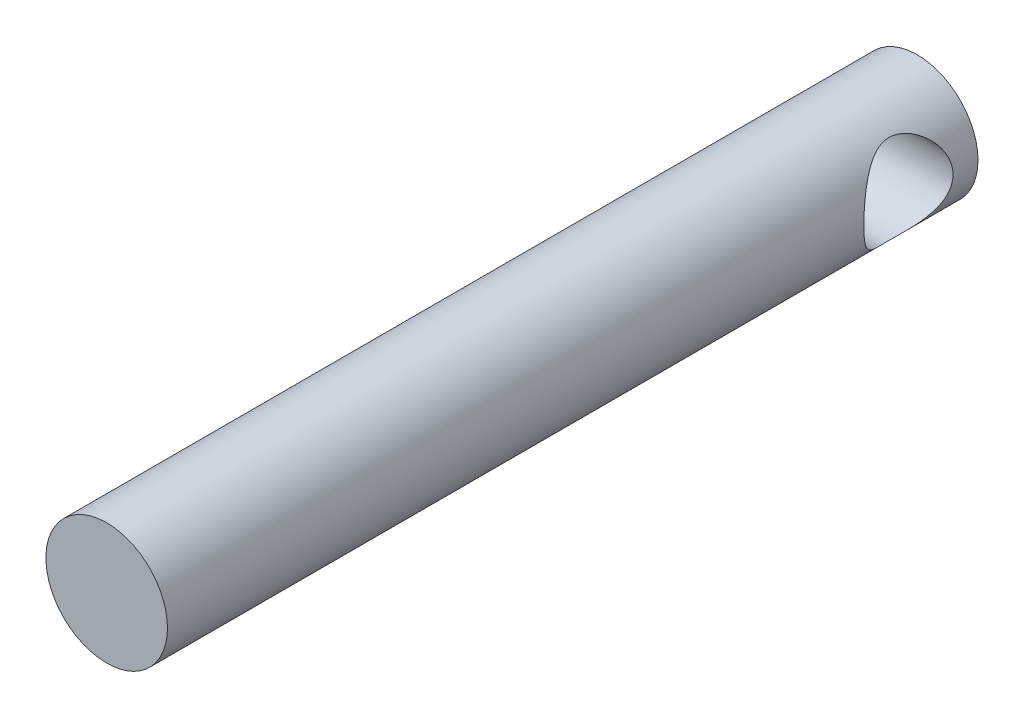
ISO-10303-21;
HEADER;
FILE_DESCRIPTION(('STEP AP214'),'2;1');
FILE_NAME('part.step','',(''),(''),'','','');
FILE_SCHEMA(('AUTOMOTIVE_DESIGN { 1 0 10303 214 1 1 1 1 }'));
ENDSEC;
DATA;
#1=APPLICATION_CONTEXT('core data for automotive mechanical design processes');
#2=APPLICATION_PROTOCOL_DEFINITION('international standard','automotive_design',2000,#1);
#3=PRODUCT_CONTEXT('',#1,'mechanical');
#4=PRODUCT('Part','Part','',(#3));
#5=PRODUCT_RELATED_PRODUCT_CATEGORY('part','',(#4));
#6=PRODUCT_DEFINITION_FORMATION('','',#4);
#7=PRODUCT_DEFINITION_CONTEXT('part definition',#1,'design');
#8=PRODUCT_DEFINITION('design','',#6,#7);
#9=PRODUCT_DEFINITION_SHAPE('','',#8);
#10=(LENGTH_UNIT() NAMED_UNIT(*) SI_UNIT(.MILLI.,.METRE.));
#11=(NAMED_UNIT(*) PLANE_ANGLE_UNIT() SI_UNIT($,.RADIAN.));
#12=(NAMED_UNIT(*) SI_UNIT($,.STERADIAN.) SOLID_ANGLE_UNIT());
#13=UNCERTAINTY_MEASURE_WITH_UNIT(LENGTH_MEASURE(1.E-05),#10,'distance_accuracy_value','');
#14=(GEOMETRIC_REPRESENTATION_CONTEXT(3) GLOBAL_UNCERTAINTY_ASSIGNED_CONTEXT((#13)) GLOBAL_UNIT_ASSIGNED_CONTEXT((#10,
#11,#12)) REPRESENTATION_CONTEXT('',''));
#15=CARTESIAN_POINT('',(0.,0.,0.));
#16=DIRECTION('',(0.,0.,1.));
#17=DIRECTION('',(1.,0.,0.));
#18=AXIS2_PLACEMENT_3D('',#15,#16,#17);
#19=CARTESIAN_POINT('',(0.,0.,100.));
#20=DIRECTION('',(0.,0.,-1.));
#21=DIRECTION('',(-1.,0.,0.));
#22=AXIS2_PLACEMENT_3D('',#19,#20,#21);
#23=CYLINDRICAL_SURFACE('',#22,7.5);
#24=CARTESIAN_POINT('',(-7.5,0.,3.08597047534755));
#25=CARTESIAN_POINT('',(-7.49999872781919,0.135055376285235,3.08597179854398));
#26=CARTESIAN_POINT('',(-7.49634306059152,0.270144536737901,3.09095397315725));
#27=CARTESIAN_POINT('',(-7.48180308421566,0.539261470162019,3.11080639864596));
#28=CARTESIAN_POINT('',(-7.47091446264143,0.67328856163776,3.12568254850565));
#29=CARTESIAN_POINT('',(-7.44214015531739,0.9394116802929,3.16511884737146));
#30=CARTESIAN_POINT('',(-7.42424110508039,1.07150351620524,3.18969749365812));
#31=CARTESIAN_POINT('',(-7.38185166150815,1.33257988419793,3.24816766952421));
#32=CARTESIAN_POINT('',(-7.35735834023733,1.46156300818846,3.28206333611316));
#33=CARTESIAN_POINT('',(-7.30249183815425,1.71472311019973,3.35843862134301));
#34=CARTESIAN_POINT('',(-7.27215771357647,1.83892577867661,3.40086130004706));
#35=CARTESIAN_POINT('',(-7.20611318793602,2.08276667780845,3.49390453815138));
#36=CARTESIAN_POINT('',(-7.17040066629477,2.2024030846663,3.5445283316616));
#37=CARTESIAN_POINT('',(-7.05622669753856,2.55344016572005,3.70781174000904));
#38=CARTESIAN_POINT('',(-6.97065447299209,2.77729966822013,3.83198506910978));
#39=CARTESIAN_POINT('',(-6.77776227191752,3.22115916269509,4.11937813755444));
#40=CARTESIAN_POINT('',(-6.6691694070733,3.43893620340117,4.2851294084911));
#41=CARTESIAN_POINT('',(-6.44324402134699,3.84561003935518,4.64451900701212));
#42=CARTESIAN_POINT('',(-6.32589794860186,4.03446060980524,4.83820102895981));
#43=CARTESIAN_POINT('',(-6.13800764446043,4.31168247542055,5.16759191390637));
#44=CARTESIAN_POINT('',(-6.06763426733091,4.409904087226,5.29526179990379));
#45=CARTESIAN_POINT('',(-5.92853120141975,4.59520635302921,5.55940236700665));
#46=CARTESIAN_POINT('',(-5.85980199240363,4.68228378665279,5.6958755749819));
#47=CARTESIAN_POINT('',(-5.72626078142968,4.84468579485347,5.97726090074965));
#48=CARTESIAN_POINT('',(-5.66144448655279,4.92002339840692,6.12216341468201));
#49=CARTESIAN_POINT('',(-5.53822634478387,5.05832181904602,6.42023903924434));
#50=CARTESIAN_POINT('',(-5.47982091608781,5.121289562966,6.57340745954835));
#51=CARTESIAN_POINT('',(-5.35442072304565,5.25271123356576,6.94023868191979));
#52=CARTESIAN_POINT('',(-5.29101908166431,5.31603747165639,7.1570930844747));
#53=CARTESIAN_POINT('',(-5.21419227145622,5.3910549643512,7.49073723137132));
#54=CARTESIAN_POINT('',(-5.19163660964995,5.41272576289551,7.60328201187608));
#55=CARTESIAN_POINT('',(-5.15344634139993,5.44909999266488,7.83063095383464));
#56=CARTESIAN_POINT('',(-5.13780835747329,5.46380682422056,7.94543398406125));
#57=CARTESIAN_POINT('',(-5.11404468692043,5.48605660978944,8.17746374036437));
#58=CARTESIAN_POINT('',(-5.1059811447753,5.49354031520013,8.2947025855346));
#59=CARTESIAN_POINT('',(-5.09797815371618,5.50096807092452,8.52969650054809));
#60=CARTESIAN_POINT('',(-5.09803838234576,5.50091242049748,8.64745154971617));
#61=CARTESIAN_POINT('',(-5.10628189650357,5.49326092931533,8.88247313926765));
#62=CARTESIAN_POINT('',(-5.11446836477208,5.4856621341961,8.99973947016736));
#63=CARTESIAN_POINT('',(-5.13857352751111,5.46308811304013,9.23279944078204));
#64=CARTESIAN_POINT('',(-5.15449611659219,5.44810917154818,9.34859230854562));
#65=CARTESIAN_POINT('',(-5.1954642444704,5.40906947975743,9.59021821604044));
#66=CARTESIAN_POINT('',(-5.22130921965144,5.38420273305327,9.71578530526354));
#67=CARTESIAN_POINT('',(-5.28038625532567,5.3262777494127,9.96326710451768));
#68=CARTESIAN_POINT('',(-5.31362326400076,5.29321402376028,10.0851793056641));
#69=CARTESIAN_POINT('',(-5.42250426028369,5.18238609517369,10.4449698756281));
#70=CARTESIAN_POINT('',(-5.50726798460308,5.09302987876594,10.676635577664));
#71=CARTESIAN_POINT('',(-5.6609673321388,4.92058517703288,11.0487403371496));
#72=CARTESIAN_POINT('',(-5.72610583155606,4.84488221009645,11.1943763599482));
#73=CARTESIAN_POINT('',(-5.86029971812211,4.68167049468289,11.4770912564212));
#74=CARTESIAN_POINT('',(-5.92935637190767,4.59415791571924,11.6141673324591));
#75=CARTESIAN_POINT('',(-6.06920583646394,4.40775882242906,11.8796004970038));
#76=CARTESIAN_POINT('',(-6.14000021296856,4.30886173045789,12.0079492977922));
#77=CARTESIAN_POINT('',(-6.28133658605871,4.10008541692263,12.2555082660752));
#78=CARTESIAN_POINT('',(-6.35187861052145,3.99020744981545,12.3747194747066));
#79=CARTESIAN_POINT('',(-6.491956366296,3.75807666806383,12.6051724549875));
#80=CARTESIAN_POINT('',(-6.56146368744374,3.63567060437135,12.7162774127622));
#81=CARTESIAN_POINT('',(-6.69671757514575,3.38007095364637,12.9279342129075));
#82=CARTESIAN_POINT('',(-6.76246373912707,3.24687621552764,13.0284849265697));
#83=CARTESIAN_POINT('',(-6.88838914312177,2.97037524158165,13.2179138283151));
#84=CARTESIAN_POINT('',(-6.94857895584762,2.82708916401772,13.3068143258304));
#85=CARTESIAN_POINT('',(-7.06187749472335,2.53081248353643,13.4720454833553));
#86=CARTESIAN_POINT('',(-7.11498887428151,2.37782554898164,13.5483808560409));
#87=CARTESIAN_POINT('',(-7.2000517197271,2.10339995807772,13.6694822047324));
#88=CARTESIAN_POINT('',(-7.23393950587857,1.98391039838395,13.7173273430677));
#89=CARTESIAN_POINT('',(-7.29630003042455,1.74062165575659,13.8048725890052));
#90=CARTESIAN_POINT('',(-7.32477396550157,1.61682343238804,13.8445744967474));
#91=CARTESIAN_POINT('',(-7.37573339701597,1.36563919041155,13.9153273866667));
#92=CARTESIAN_POINT('',(-7.39822200531386,1.23825507440744,13.94638286464));
#93=CARTESIAN_POINT('',(-7.43675314233005,0.980643834670608,13.9994379643167));
#94=CARTESIAN_POINT('',(-7.45279550586377,0.850416638174297,14.0214373539589));
#95=CARTESIAN_POINT('',(-7.47812124681698,0.587542047162258,14.0561111029814));
#96=CARTESIAN_POINT('',(-7.48737768757857,0.454887127086312,14.0687483013015));
#97=CARTESIAN_POINT('',(-7.49880900094007,0.188703221563385,14.0843488482249));
#98=CARTESIAN_POINT('',(-7.50098388430415,0.055174237445314,14.0873122115327));
#99=CARTESIAN_POINT('',(-7.49819970625039,-0.211672215431253,14.0835154275062));
#100=CARTESIAN_POINT('',(-7.49324052710339,-0.344989680662833,14.0767551197079));
#101=CARTESIAN_POINT('',(-7.47630731285209,-0.610330928966863,14.0536237914234));
#102=CARTESIAN_POINT('',(-7.46433348886744,-0.74235475085249,14.0372530601819));
#103=CARTESIAN_POINT('',(-7.43458404888988,-0.996127598183575,13.99644394322));
#104=CARTESIAN_POINT('',(-7.41720623271196,-1.11801265783861,13.9725576795728));
#105=CARTESIAN_POINT('',(-7.3768555483523,-1.35902913349132,13.9168579726806));
#106=CARTESIAN_POINT('',(-7.35388077440325,-1.47815959638696,13.8850418292217));
#107=CARTESIAN_POINT('',(-7.2771855252572,-1.83033961107277,13.7782646761783));
#108=CARTESIAN_POINT('',(-7.2156707674409,-2.05836895903749,13.6919434743005));
#109=CARTESIAN_POINT('',(-7.07042015885762,-2.51415347482978,13.4846177503613));
#110=CARTESIAN_POINT('',(-6.9853050014875,-2.74044117807819,13.3613989176591));
#111=CARTESIAN_POINT('',(-6.80123924784217,-3.16982089007015,13.0878693603201));
#112=CARTESIAN_POINT('',(-6.70228010778746,-3.37289843301909,12.9375418889684));
#113=CARTESIAN_POINT('',(-6.4774144719406,-3.78930950711465,12.5833458299695));
#114=CARTESIAN_POINT('',(-6.34989238638164,-3.99770705663352,12.3747138159197));
#115=CARTESIAN_POINT('',(-6.0934354440748,-4.3786640149564,11.9271926189942));
#116=CARTESIAN_POINT('',(-5.9644993924964,-4.55119018353756,11.688275699621));
#117=CARTESIAN_POINT('',(-5.7855861135287,-4.77335116540849,11.3214350170788));
#118=CARTESIAN_POINT('',(-5.73120268589005,-4.83836790797266,11.2047808389871));
#119=CARTESIAN_POINT('',(-5.62600457678679,-4.96029747028213,10.9657756008219));
#120=CARTESIAN_POINT('',(-5.57519008084769,-5.01720986889319,10.8434242451382));
#121=CARTESIAN_POINT('',(-5.43051020385196,-5.17492197581214,10.468400332542));
#122=CARTESIAN_POINT('',(-5.34408309596921,-5.26308513884061,10.207123385651));
#123=CARTESIAN_POINT('',(-5.22145346456742,-5.38444238861026,9.72785370711709));
#124=CARTESIAN_POINT('',(-5.17827183206794,-5.42561477238887,9.51372310800645));
#125=CARTESIAN_POINT('',(-5.13323849505432,-5.46811147921666,9.18748915160827));
#126=CARTESIAN_POINT('',(-5.12151761069926,-5.4790664673344,9.0779274900422));
#127=CARTESIAN_POINT('',(-5.10508638352146,-5.49438197669627,8.85783887353597));
#128=CARTESIAN_POINT('',(-5.10037345478035,-5.49874493039446,8.74731228980039));
#129=CARTESIAN_POINT('',(-5.09816790615531,-5.50078933677458,8.52585121460462));
#130=CARTESIAN_POINT('',(-5.10069338025312,-5.49845404570806,8.41491639444144));
#131=CARTESIAN_POINT('',(-5.11288750021936,-5.48711674545356,8.19378891071827));
#132=CARTESIAN_POINT('',(-5.12255610208961,-5.47811477732905,8.08359624259119));
#133=CARTESIAN_POINT('',(-5.1486386254202,-5.45360781633496,7.86464492862954));
#134=CARTESIAN_POINT('',(-5.16505903855263,-5.43809656468042,7.75588776714589));
#135=CARTESIAN_POINT('',(-5.20401147899249,-5.40083219264973,7.54052035196363));
#136=CARTESIAN_POINT('',(-5.22654668880262,-5.37907582160102,7.43391124736686));
#137=CARTESIAN_POINT('',(-5.28416429207551,-5.32256219838172,7.19325103150881));
#138=CARTESIAN_POINT('',(-5.32099189458983,-5.28586628572407,7.0600712594805));
#139=CARTESIAN_POINT('',(-5.40173729559201,-5.20332237260051,6.79872596922428));
#140=CARTESIAN_POINT('',(-5.44566064268792,-5.15746720324805,6.6705644733383));
#141=CARTESIAN_POINT('',(-5.53898476067651,-5.05710891977597,6.41941191219419));
#142=CARTESIAN_POINT('',(-5.58839698732747,-5.0025876125532,6.2964324285748));
#143=CARTESIAN_POINT('',(-5.69106606555172,-4.88547151161298,6.05614271758081));
#144=CARTESIAN_POINT('',(-5.7443215683152,-4.8228795443102,5.93883052515066));
#145=CARTESIAN_POINT('',(-5.86815946869371,-4.67189928198876,5.67879046555703));
#146=CARTESIAN_POINT('',(-5.93951892192237,-4.58112221939404,5.53781491634325));
#147=CARTESIAN_POINT('',(-6.08390491099018,-4.38756103655435,5.2652391097885));
#148=CARTESIAN_POINT('',(-6.15693189903125,-4.28477362747145,5.13364143638267));
#149=CARTESIAN_POINT('',(-6.30248987083129,-4.06763974643133,4.88028366797739));
#150=CARTESIAN_POINT('',(-6.37502122231343,-3.95330313867053,4.75851533501611));
#151=CARTESIAN_POINT('',(-6.51778084543039,-3.71322507453858,4.5251846739232));
#152=CARTESIAN_POINT('',(-6.58800843456112,-3.58748027923322,4.41362535306718));
#153=CARTESIAN_POINT('',(-6.71361872569178,-3.34557481560278,4.21820721600104));
#154=CARTESIAN_POINT('',(-6.76959994295165,-3.23101345039067,4.13275035792778));
#155=CARTESIAN_POINT('',(-6.87757829529997,-2.99429988597506,3.9702615563987));
#156=CARTESIAN_POINT('',(-6.92957618722729,-2.8721491367956,3.89322801130376));
#157=CARTESIAN_POINT('',(-7.02852674821951,-2.62069734322939,3.74830698989008));
#158=CARTESIAN_POINT('',(-7.07548275384994,-2.49140111440139,3.68041345734679));
#159=CARTESIAN_POINT('',(-7.16336813757383,-2.22613270064982,3.55448192094648));
#160=CARTESIAN_POINT('',(-7.20429864461332,-2.09016177268971,3.49644207057636));
#161=CARTESIAN_POINT('',(-7.2735678661188,-1.83308206058562,3.39889193509535));
#162=CARTESIAN_POINT('',(-7.30287426185105,-1.71279149527973,3.35790863398388));
#163=CARTESIAN_POINT('',(-7.35588349079815,-1.46853230969731,3.28411404302907));
#164=CARTESIAN_POINT('',(-7.37958731123702,-1.34456434175159,3.25130131340312));
#165=CARTESIAN_POINT('',(-7.42087588623365,-1.0939370844016,3.19433035301489));
#166=CARTESIAN_POINT('',(-7.43847355548644,-0.967284083858489,3.17015385312983));
#167=CARTESIAN_POINT('',(-7.46723870549868,-0.711924660657242,3.13071272536483));
#168=CARTESIAN_POINT('',(-7.4784095918494,-0.583219362754491,3.11544337747106));
#169=CARTESIAN_POINT('',(-7.49082132823811,-0.378563008870326,3.0984919830267));
#170=CARTESIAN_POINT('',(-7.49426031962745,-0.302977112208774,3.0937994668424));
#171=CARTESIAN_POINT('',(-7.49885015595833,-0.15159770801625,3.08753814586164));
#172=CARTESIAN_POINT('',(-7.50000071405242,-0.0758041756510316,3.08596973266098));
#173=CARTESIAN_POINT('',(-7.5,0.,3.08597047534755));
#174=B_SPLINE_CURVE_WITH_KNOTS('',3,(#24,#25,#26,#27,#28,#29,#30,#31,#32,#33,#34,#35,#36,#37,
#38,#39,#40,#41,#42,#43,#44,#45,#46,#47,#48,#49,#50,#51,#52,#53,#54,#55,#56,#57,#58,#59,#60,#61,
#62,#63,#64,#65,#66,#67,#68,#69,#70,#71,#72,#73,#74,#75,#76,#77,#78,#79,#80,#81,#82,#83,#84,#85,
#86,#87,#88,#89,#90,#91,#92,#93,#94,#95,#96,#97,#98,#99,#100,#101,#102,#103,#104,#105,#106,#107,
#108,#109,#110,#111,#112,#113,#114,#115,#116,#117,#118,#119,#120,#121,#122,#123,#124,#125,#126,
#127,#128,#129,#130,#131,#132,#133,#134,#135,#136,#137,#138,#139,#140,#141,#142,#143,#144,#145,
#146,#147,#148,#149,#150,#151,#152,#153,#154,#155,#156,#157,#158,#159,#160,#161,#162,#163,#164,
#165,#166,#167,#168,#169,#170,#171,#172,#173),.UNSPECIFIED.,.T.,.F.,(4,2,2,2,2,2,2,2,2,2,2,2,2,
2,2,2,2,2,2,2,2,2,2,2,2,2,2,2,2,2,2,2,2,2,2,2,2,2,2,2,2,2,2,2,2,2,2,2,2,2,2,2,2,2,2,2,2,2,2,2,2,
2,2,2,2,2,2,2,2,2,2,2,2,2,4),(0.,0.405084678598993,0.810411093486331,1.21651400218459,
1.6227975236825,2.02645316243227,2.43026837202856,3.23684806222179,4.11715055319306,
4.99884542112994,5.52569884024144,6.05270416399921,6.57912038152025,7.10524097259587,
7.806157309861,8.15623361395328,8.50613880784489,8.85889034751931,9.21162788544878,
9.56450363184444,9.91755721153761,10.3087330555004,10.7001715425412,11.4838631988305,
12.0130929491456,12.5424947713196,13.0723925060716,13.6022297742729,14.1395725330086,
14.6769726986712,15.2133282519053,15.7494821789707,16.148388676375,16.5472068963585,
16.9458173579521,17.3444380332601,17.744632586486,18.1448265314049,18.5450270805614,
18.9452155855083,19.3210291906595,19.6969709398558,20.4482755902175,21.25940071421,
22.0710286486779,23.0313359579053,23.9925292086959,24.4247911809861,24.8570756071531,
25.7192319100497,26.3831376583103,26.7149563451303,27.0466525612609,27.3791786477155,
27.7117026859887,28.044547186921,28.3775652532424,28.8058220659445,29.2344153950807,
29.6639206656868,30.0932759263228,30.6392608668039,31.1853956683092,31.7310678969163,
32.276900350608,32.7369545085679,33.1969210374958,33.65658127391,34.1161552778139,
34.5070029259783,34.8977816518507,35.2877287575536,35.6774690371395,35.904807353215,
36.1321741635907),.UNSPECIFIED.);
#175=CARTESIAN_POINT('',(-7.5,0.,3.08597047534755));
#176=VERTEX_POINT('',#175);
#177=EDGE_CURVE('E10',#176,#176,#174,.T.);
#178=ORIENTED_EDGE('',*,*,#177,.T.);
#179=EDGE_LOOP('',(#178));
#180=FACE_BOUND('',#179,.T.);
#181=CARTESIAN_POINT('',(7.5,0.,3.08597047534755));
#182=CARTESIAN_POINT('',(7.49999872781919,-0.135055376285235,3.08597179854398));
#183=CARTESIAN_POINT('',(7.49634306059152,-0.270144536737901,3.09095397315725));
#184=CARTESIAN_POINT('',(7.48180308421566,-0.539261470162019,3.11080639864596));
#185=CARTESIAN_POINT('',(7.47091446264143,-0.67328856163776,3.12568254850565));
#186=CARTESIAN_POINT('',(7.44214015531739,-0.9394116802929,3.16511884737146));
#187=CARTESIAN_POINT('',(7.42424110508039,-1.07150351620524,3.18969749365812));
#188=CARTESIAN_POINT('',(7.38185166150815,-1.33257988419793,3.24816766952421));
#189=CARTESIAN_POINT('',(7.35735834023733,-1.46156300818846,3.28206333611316));
#190=CARTESIAN_POINT('',(7.30249183815425,-1.71472311019973,3.35843862134301));
#191=CARTESIAN_POINT('',(7.27215771357647,-1.83892577867661,3.40086130004706));
#192=CARTESIAN_POINT('',(7.20611318793602,-2.08276667780845,3.49390453815138));
#193=CARTESIAN_POINT('',(7.17040066629477,-2.2024030846663,3.5445283316616));
#194=CARTESIAN_POINT('',(7.05622669753856,-2.55344016572005,3.70781174000904));
#195=CARTESIAN_POINT('',(6.97065447299209,-2.77729966822013,3.83198506910978));
#196=CARTESIAN_POINT('',(6.77776227191752,-3.22115916269509,4.11937813755444));
#197=CARTESIAN_POINT('',(6.6691694070733,-3.43893620340117,4.2851294084911));
#198=CARTESIAN_POINT('',(6.44324402134699,-3.84561003935518,4.64451900701212));
#199=CARTESIAN_POINT('',(6.32589794860186,-4.03446060980524,4.83820102895981));
#200=CARTESIAN_POINT('',(6.13800764446043,-4.31168247542055,5.16759191390637));
#201=CARTESIAN_POINT('',(6.06763426733091,-4.409904087226,5.29526179990379));
#202=CARTESIAN_POINT('',(5.92853120141975,-4.59520635302921,5.55940236700665));
#203=CARTESIAN_POINT('',(5.85980199240363,-4.68228378665279,5.6958755749819));
#204=CARTESIAN_POINT('',(5.72626078142968,-4.84468579485347,5.97726090074965));
#205=CARTESIAN_POINT('',(5.66144448655279,-4.92002339840692,6.12216341468201));
#206=CARTESIAN_POINT('',(5.53822634478387,-5.05832181904602,6.42023903924434));
#207=CARTESIAN_POINT('',(5.47982091608781,-5.121289562966,6.57340745954835));
#208=CARTESIAN_POINT('',(5.35442072304565,-5.25271123356576,6.94023868191979));
#209=CARTESIAN_POINT('',(5.29101908166431,-5.31603747165639,7.1570930844747));
#210=CARTESIAN_POINT('',(5.21419227145622,-5.3910549643512,7.49073723137132));
#211=CARTESIAN_POINT('',(5.19163660964995,-5.41272576289551,7.60328201187608));
#212=CARTESIAN_POINT('',(5.15344634139993,-5.44909999266488,7.83063095383464));
#213=CARTESIAN_POINT('',(5.13780835747329,-5.46380682422056,7.94543398406125));
#214=CARTESIAN_POINT('',(5.11404468692043,-5.48605660978944,8.17746374036437));
#215=CARTESIAN_POINT('',(5.1059811447753,-5.49354031520013,8.2947025855346));
#216=CARTESIAN_POINT('',(5.09797815371618,-5.50096807092452,8.52969650054809));
#217=CARTESIAN_POINT('',(5.09803838234576,-5.50091242049748,8.64745154971617));
#218=CARTESIAN_POINT('',(5.10628189650357,-5.49326092931533,8.88247313926765));
#219=CARTESIAN_POINT('',(5.11446836477208,-5.4856621341961,8.99973947016736));
#220=CARTESIAN_POINT('',(5.13857352751111,-5.46308811304013,9.23279944078204));
#221=CARTESIAN_POINT('',(5.15449611659219,-5.44810917154818,9.34859230854562));
#222=CARTESIAN_POINT('',(5.1954642444704,-5.40906947975743,9.59021821604044));
#223=CARTESIAN_POINT('',(5.22130921965144,-5.38420273305327,9.71578530526354));
#224=CARTESIAN_POINT('',(5.28038625532567,-5.3262777494127,9.96326710451768));
#225=CARTESIAN_POINT('',(5.31362326400076,-5.29321402376028,10.0851793056641));
#226=CARTESIAN_POINT('',(5.42250426028369,-5.18238609517369,10.4449698756281));
#227=CARTESIAN_POINT('',(5.50726798460308,-5.09302987876594,10.676635577664));
#228=CARTESIAN_POINT('',(5.6609673321388,-4.92058517703288,11.0487403371496));
#229=CARTESIAN_POINT('',(5.72610583155606,-4.84488221009645,11.1943763599482));
#230=CARTESIAN_POINT('',(5.86029971812211,-4.68167049468289,11.4770912564212));
#231=CARTESIAN_POINT('',(5.92935637190767,-4.59415791571924,11.6141673324591));
#232=CARTESIAN_POINT('',(6.06920583646394,-4.40775882242906,11.8796004970038));
#233=CARTESIAN_POINT('',(6.14000021296856,-4.30886173045789,12.0079492977922));
#234=CARTESIAN_POINT('',(6.28133658605871,-4.10008541692263,12.2555082660752));
#235=CARTESIAN_POINT('',(6.35187861052145,-3.99020744981545,12.3747194747066));
#236=CARTESIAN_POINT('',(6.491956366296,-3.75807666806383,12.6051724549875));
#237=CARTESIAN_POINT('',(6.56146368744374,-3.63567060437135,12.7162774127622));
#238=CARTESIAN_POINT('',(6.69671757514575,-3.38007095364637,12.9279342129075));
#239=CARTESIAN_POINT('',(6.76246373912707,-3.24687621552764,13.0284849265697));
#240=CARTESIAN_POINT('',(6.88838914312177,-2.97037524158165,13.2179138283151));
#241=CARTESIAN_POINT('',(6.94857895584762,-2.82708916401772,13.3068143258304));
#242=CARTESIAN_POINT('',(7.06187749472335,-2.53081248353643,13.4720454833553));
#243=CARTESIAN_POINT('',(7.11498887428151,-2.37782554898164,13.5483808560409));
#244=CARTESIAN_POINT('',(7.2000517197271,-2.10339995807772,13.6694822047324));
#245=CARTESIAN_POINT('',(7.23393950587857,-1.98391039838395,13.7173273430677));
#246=CARTESIAN_POINT('',(7.29630003042455,-1.74062165575659,13.8048725890052));
#247=CARTESIAN_POINT('',(7.32477396550157,-1.61682343238804,13.8445744967474));
#248=CARTESIAN_POINT('',(7.37573339701597,-1.36563919041155,13.9153273866667));
#249=CARTESIAN_POINT('',(7.39822200531386,-1.23825507440744,13.94638286464));
#250=CARTESIAN_POINT('',(7.43675314233005,-0.980643834670608,13.9994379643167));
#251=CARTESIAN_POINT('',(7.45279550586377,-0.850416638174297,14.0214373539589));
#252=CARTESIAN_POINT('',(7.47812124681698,-0.587542047162258,14.0561111029814));
#253=CARTESIAN_POINT('',(7.48737768757857,-0.454887127086312,14.0687483013015));
#254=CARTESIAN_POINT('',(7.49880900094007,-0.188703221563385,14.0843488482249));
#255=CARTESIAN_POINT('',(7.50098388430415,-0.055174237445314,14.0873122115327));
#256=CARTESIAN_POINT('',(7.49819970625039,0.211672215431253,14.0835154275062));
#257=CARTESIAN_POINT('',(7.49324052710339,0.344989680662833,14.0767551197079));
#258=CARTESIAN_POINT('',(7.47630731285209,0.610330928966863,14.0536237914234));
#259=CARTESIAN_POINT('',(7.46433348886744,0.74235475085249,14.0372530601819));
#260=CARTESIAN_POINT('',(7.43458404888988,0.996127598183575,13.99644394322));
#261=CARTESIAN_POINT('',(7.41720623271196,1.11801265783861,13.9725576795728));
#262=CARTESIAN_POINT('',(7.3768555483523,1.35902913349132,13.9168579726806));
#263=CARTESIAN_POINT('',(7.35388077440325,1.47815959638696,13.8850418292217));
#264=CARTESIAN_POINT('',(7.2771855252572,1.83033961107277,13.7782646761783));
#265=CARTESIAN_POINT('',(7.2156707674409,2.05836895903749,13.6919434743005));
#266=CARTESIAN_POINT('',(7.07042015885762,2.51415347482978,13.4846177503613));
#267=CARTESIAN_POINT('',(6.9853050014875,2.74044117807819,13.3613989176591));
#268=CARTESIAN_POINT('',(6.80123924784217,3.16982089007015,13.0878693603201));
#269=CARTESIAN_POINT('',(6.70228010778746,3.37289843301909,12.9375418889684));
#270=CARTESIAN_POINT('',(6.4774144719406,3.78930950711465,12.5833458299695));
#271=CARTESIAN_POINT('',(6.34989238638164,3.99770705663352,12.3747138159197));
#272=CARTESIAN_POINT('',(6.0934354440748,4.3786640149564,11.9271926189942));
#273=CARTESIAN_POINT('',(5.9644993924964,4.55119018353756,11.688275699621));
#274=CARTESIAN_POINT('',(5.7855861135287,4.77335116540849,11.3214350170788));
#275=CARTESIAN_POINT('',(5.73120268589005,4.83836790797266,11.2047808389871));
#276=CARTESIAN_POINT('',(5.62600457678679,4.96029747028213,10.9657756008219));
#277=CARTESIAN_POINT('',(5.57519008084769,5.01720986889319,10.8434242451382));
#278=CARTESIAN_POINT('',(5.43051020385196,5.17492197581214,10.468400332542));
#279=CARTESIAN_POINT('',(5.34408309596921,5.26308513884061,10.207123385651));
#280=CARTESIAN_POINT('',(5.22145346456742,5.38444238861026,9.72785370711709));
#281=CARTESIAN_POINT('',(5.17827183206794,5.42561477238887,9.51372310800645));
#282=CARTESIAN_POINT('',(5.13323849505432,5.46811147921666,9.18748915160827));
#283=CARTESIAN_POINT('',(5.12151761069926,5.4790664673344,9.0779274900422));
#284=CARTESIAN_POINT('',(5.10508638352146,5.49438197669627,8.85783887353597));
#285=CARTESIAN_POINT('',(5.10037345478035,5.49874493039446,8.74731228980039));
#286=CARTESIAN_POINT('',(5.09816790615531,5.50078933677458,8.52585121460462));
#287=CARTESIAN_POINT('',(5.10069338025312,5.49845404570806,8.41491639444144));
#288=CARTESIAN_POINT('',(5.11288750021936,5.48711674545356,8.19378891071827));
#289=CARTESIAN_POINT('',(5.12255610208961,5.47811477732905,8.08359624259119));
#290=CARTESIAN_POINT('',(5.1486386254202,5.45360781633496,7.86464492862954));
#291=CARTESIAN_POINT('',(5.16505903855263,5.43809656468042,7.75588776714589));
#292=CARTESIAN_POINT('',(5.20401147899249,5.40083219264973,7.54052035196363));
#293=CARTESIAN_POINT('',(5.22654668880262,5.37907582160102,7.43391124736686));
#294=CARTESIAN_POINT('',(5.28416429207551,5.32256219838172,7.19325103150881));
#295=CARTESIAN_POINT('',(5.32099189458983,5.28586628572407,7.0600712594805));
#296=CARTESIAN_POINT('',(5.40173729559201,5.20332237260051,6.79872596922428));
#297=CARTESIAN_POINT('',(5.44566064268792,5.15746720324805,6.6705644733383));
#298=CARTESIAN_POINT('',(5.53898476067651,5.05710891977597,6.41941191219419));
#299=CARTESIAN_POINT('',(5.58839698732747,5.0025876125532,6.2964324285748));
#300=CARTESIAN_POINT('',(5.69106606555172,4.88547151161298,6.05614271758081));
#301=CARTESIAN_POINT('',(5.7443215683152,4.8228795443102,5.93883052515066));
#302=CARTESIAN_POINT('',(5.86815946869371,4.67189928198876,5.67879046555703));
#303=CARTESIAN_POINT('',(5.93951892192237,4.58112221939404,5.53781491634325));
#304=CARTESIAN_POINT('',(6.08390491099018,4.38756103655435,5.2652391097885));
#305=CARTESIAN_POINT('',(6.15693189903125,4.28477362747145,5.13364143638267));
#306=CARTESIAN_POINT('',(6.30248987083129,4.06763974643133,4.88028366797739));
#307=CARTESIAN_POINT('',(6.37502122231343,3.95330313867053,4.75851533501611));
#308=CARTESIAN_POINT('',(6.51778084543039,3.71322507453858,4.5251846739232));
#309=CARTESIAN_POINT('',(6.58800843456112,3.58748027923322,4.41362535306718));
#310=CARTESIAN_POINT('',(6.71361872569178,3.34557481560278,4.21820721600104));
#311=CARTESIAN_POINT('',(6.76959994295165,3.23101345039067,4.13275035792778));
#312=CARTESIAN_POINT('',(6.87757829529997,2.99429988597506,3.9702615563987));
#313=CARTESIAN_POINT('',(6.92957618722729,2.8721491367956,3.89322801130376));
#314=CARTESIAN_POINT('',(7.02852674821951,2.62069734322939,3.74830698989008));
#315=CARTESIAN_POINT('',(7.07548275384994,2.49140111440139,3.68041345734679));
#316=CARTESIAN_POINT('',(7.16336813757383,2.22613270064982,3.55448192094648));
#317=CARTESIAN_POINT('',(7.20429864461332,2.09016177268971,3.49644207057636));
#318=CARTESIAN_POINT('',(7.2735678661188,1.83308206058562,3.39889193509535));
#319=CARTESIAN_POINT('',(7.30287426185105,1.71279149527973,3.35790863398388));
#320=CARTESIAN_POINT('',(7.35588349079815,1.46853230969731,3.28411404302907));
#321=CARTESIAN_POINT('',(7.37958731123702,1.34456434175159,3.25130131340312));
#322=CARTESIAN_POINT('',(7.42087588623365,1.0939370844016,3.19433035301489));
#323=CARTESIAN_POINT('',(7.43847355548644,0.967284083858489,3.17015385312983));
#324=CARTESIAN_POINT('',(7.46723870549868,0.711924660657242,3.13071272536483));
#325=CARTESIAN_POINT('',(7.4784095918494,0.583219362754491,3.11544337747106));
#326=CARTESIAN_POINT('',(7.49082132823811,0.378563008870326,3.0984919830267));
#327=CARTESIAN_POINT('',(7.49426031962745,0.302977112208774,3.0937994668424));
#328=CARTESIAN_POINT('',(7.49885015595833,0.15159770801625,3.08753814586164));
#329=CARTESIAN_POINT('',(7.50000071405242,0.0758041756510316,3.08596973266098));
#330=CARTESIAN_POINT('',(7.5,0.,3.08597047534755));
#331=B_SPLINE_CURVE_WITH_KNOTS('',3,(#181,#182,#183,#184,#185,#186,#187,#188,#189,#190,#191,
#192,#193,#194,#195,#196,#197,#198,#199,#200,#201,#202,#203,#204,#205,#206,#207,#208,#209,#210,
#211,#212,#213,#214,#215,#216,#217,#218,#219,#220,#221,#222,#223,#224,#225,#226,#227,#228,#229,
#230,#231,#232,#233,#234,#235,#236,#237,#238,#239,#240,#241,#242,#243,#244,#245,#246,#247,#248,
#249,#250,#251,#252,#253,#254,#255,#256,#257,#258,#259,#260,#261,#262,#263,#264,#265,#266,#267,
#268,#269,#270,#271,#272,#273,#274,#275,#276,#277,#278,#279,#280,#281,#282,#283,#284,#285,#286,
#287,#288,#289,#290,#291,#292,#293,#294,#295,#296,#297,#298,#299,#300,#301,#302,#303,#304,#305,
#306,#307,#308,#309,#310,#311,#312,#313,#314,#315,#316,#317,#318,#319,#320,#321,#322,#323,#324,
#325,#326,#327,#328,#329,#330),.UNSPECIFIED.,.T.,.F.,(4,2,2,2,2,2,2,2,2,2,2,2,2,2,2,2,2,2,2,2,2,
2,2,2,2,2,2,2,2,2,2,2,2,2,2,2,2,2,2,2,2,2,2,2,2,2,2,2,2,2,2,2,2,2,2,2,2,2,2,2,2,2,2,2,2,2,2,2,2,
2,2,2,2,2,4),(0.,0.405084678598993,0.810411093486331,1.21651400218459,1.6227975236825,
2.02645316243227,2.43026837202856,3.23684806222179,4.11715055319306,4.99884542112994,
5.52569884024144,6.05270416399921,6.57912038152025,7.10524097259587,7.806157309861,
8.15623361395328,8.50613880784489,8.85889034751931,9.21162788544878,9.56450363184444,
9.91755721153761,10.3087330555004,10.7001715425412,11.4838631988305,12.0130929491456,
12.5424947713196,13.0723925060716,13.6022297742729,14.1395725330086,14.6769726986712,
15.2133282519053,15.7494821789707,16.148388676375,16.5472068963585,16.9458173579521,
17.3444380332601,17.744632586486,18.1448265314049,18.5450270805614,18.9452155855083,
19.3210291906595,19.6969709398558,20.4482755902175,21.25940071421,22.0710286486779,
23.0313359579053,23.9925292086959,24.4247911809861,24.8570756071531,25.7192319100497,
26.3831376583103,26.7149563451303,27.0466525612609,27.3791786477155,27.7117026859887,
28.044547186921,28.3775652532424,28.8058220659445,29.2344153950807,29.6639206656868,
30.0932759263228,30.6392608668039,31.1853956683092,31.7310678969163,32.276900350608,
32.7369545085679,33.1969210374958,33.65658127391,34.1161552778139,34.5070029259783,
34.8977816518507,35.2877287575536,35.6774690371395,35.904807353215,36.1321741635907),.UNSPECIFIED.);
#332=CARTESIAN_POINT('',(7.5,0.,3.08597047534755));
#333=VERTEX_POINT('',#332);
#334=EDGE_CURVE('E48',#333,#333,#331,.T.);
#335=ORIENTED_EDGE('',*,*,#334,.T.);
#336=EDGE_LOOP('',(#335));
#337=FACE_BOUND('',#336,.T.);
#338=CARTESIAN_POINT('',(0.,0.,100.));
#339=DIRECTION('',(0.,0.,1.));
#340=DIRECTION('',(1.,0.,0.));
#341=AXIS2_PLACEMENT_3D('',#338,#339,#340);
#342=CIRCLE('',#341,7.5);
#343=CARTESIAN_POINT('',(7.5,0.,100.));
#344=VERTEX_POINT('',#343);
#345=EDGE_CURVE('E55',#344,#344,#342,.T.);
#346=ORIENTED_EDGE('',*,*,#345,.F.);
#347=EDGE_LOOP('',(#346));
#348=FACE_BOUND('',#347,.T.);
#349=CARTESIAN_POINT('',(0.,0.,0.));
#350=DIRECTION('',(0.,0.,1.));
#351=DIRECTION('',(1.,0.,0.));
#352=AXIS2_PLACEMENT_3D('',#349,#350,#351);
#353=CIRCLE('',#352,7.5);
#354=CARTESIAN_POINT('',(7.5,0.,0.));
#355=VERTEX_POINT('',#354);
#356=EDGE_CURVE('E59',#355,#355,#353,.T.);
#357=ORIENTED_EDGE('',*,*,#356,.T.);
#358=EDGE_LOOP('',(#357));
#359=FACE_BOUND('',#358,.T.);
#360=ADVANCED_FACE('F37',(#180,#337,#348,#359),#23,.T.);
#361=CARTESIAN_POINT('',(0.,0.,100.));
#362=DIRECTION('',(0.,0.,1.));
#363=DIRECTION('',(1.,0.,0.));
#364=AXIS2_PLACEMENT_3D('',#361,#362,#363);
#365=PLANE('',#364);
#366=ORIENTED_EDGE('',*,*,#345,.T.);
#367=EDGE_LOOP('',(#366));
#368=FACE_BOUND('',#367,.T.);
#369=ADVANCED_FACE('F70',(#368),#365,.T.);
#370=CARTESIAN_POINT('',(0.,0.,0.));
#371=DIRECTION('',(0.,0.,1.));
#372=DIRECTION('',(1.,0.,0.));
#373=AXIS2_PLACEMENT_3D('',#370,#371,#372);
#374=PLANE('',#373);
#375=ORIENTED_EDGE('',*,*,#356,.F.);
#376=EDGE_LOOP('',(#375));
#377=FACE_BOUND('',#376,.T.);
#378=ADVANCED_FACE('F68',(#377),#374,.F.);
#379=CARTESIAN_POINT('',(-7.5,0.,8.58597047534755));
#380=DIRECTION('',(1.,0.,0.));
#381=DIRECTION('',(0.,0.,-1.));
#382=AXIS2_PLACEMENT_3D('',#379,#380,#381);
#383=CYLINDRICAL_SURFACE('',#382,5.5);
#384=ORIENTED_EDGE('',*,*,#334,.F.);
#385=EDGE_LOOP('',(#384));
#386=FACE_BOUND('',#385,.T.);
#387=ORIENTED_EDGE('',*,*,#177,.F.);
#388=EDGE_LOOP('',(#387));
#389=FACE_BOUND('',#388,.T.);
#390=ADVANCED_FACE('F64',(#386,#389),#383,.F.);
#391=CLOSED_SHELL('',(#360,#369,#378,#390));
#392=MANIFOLD_SOLID_BREP('B2',#391);
#393=ADVANCED_BREP_SHAPE_REPRESENTATION('',(#18,#392),#14);
#394=SHAPE_DEFINITION_REPRESENTATION(#9,#393);
ENDSEC;
END-ISO-10303-21;
